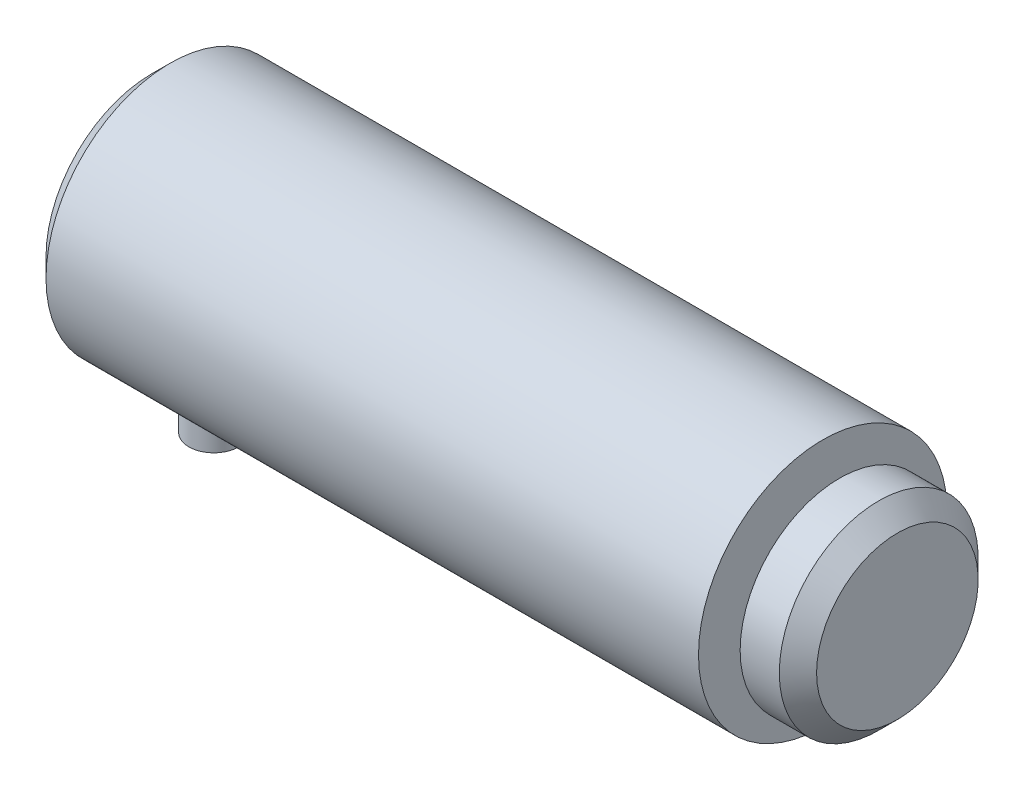
ISO-10303-21;
HEADER;
FILE_DESCRIPTION(('STEP AP214'),'2;1');
FILE_NAME('part.step','',(''),(''),'','','');
FILE_SCHEMA(('AUTOMOTIVE_DESIGN { 1 0 10303 214 1 1 1 1 }'));
ENDSEC;
DATA;
#1=APPLICATION_CONTEXT('core data for automotive mechanical design processes');
#2=APPLICATION_PROTOCOL_DEFINITION('international standard','automotive_design',2000,#1);
#3=PRODUCT_CONTEXT('',#1,'mechanical');
#4=PRODUCT('Part','Part','',(#3));
#5=PRODUCT_RELATED_PRODUCT_CATEGORY('part','',(#4));
#6=PRODUCT_DEFINITION_FORMATION('','',#4);
#7=PRODUCT_DEFINITION_CONTEXT('part definition',#1,'design');
#8=PRODUCT_DEFINITION('design','',#6,#7);
#9=PRODUCT_DEFINITION_SHAPE('','',#8);
#10=(LENGTH_UNIT() NAMED_UNIT(*) SI_UNIT(.MILLI.,.METRE.));
#11=(NAMED_UNIT(*) PLANE_ANGLE_UNIT() SI_UNIT($,.RADIAN.));
#12=(NAMED_UNIT(*) SI_UNIT($,.STERADIAN.) SOLID_ANGLE_UNIT());
#13=UNCERTAINTY_MEASURE_WITH_UNIT(LENGTH_MEASURE(1.E-05),#10,'distance_accuracy_value','');
#14=(GEOMETRIC_REPRESENTATION_CONTEXT(3) GLOBAL_UNCERTAINTY_ASSIGNED_CONTEXT((#13)) GLOBAL_UNIT_ASSIGNED_CONTEXT((#10,
#11,#12)) REPRESENTATION_CONTEXT('',''));
#15=CARTESIAN_POINT('',(0.,0.,0.));
#16=DIRECTION('',(0.,0.,1.));
#17=DIRECTION('',(1.,0.,0.));
#18=AXIS2_PLACEMENT_3D('',#15,#16,#17);
#19=CARTESIAN_POINT('',(30.,0.,0.));
#20=DIRECTION('',(-1.,0.,0.));
#21=DIRECTION('',(0.,0.,1.));
#22=AXIS2_PLACEMENT_3D('',#19,#20,#21);
#23=CYLINDRICAL_SURFACE('',#22,8.);
#24=CARTESIAN_POINT('',(25.35,0.,0.));
#25=DIRECTION('',(-1.,0.,0.));
#26=DIRECTION('',(0.,0.,1.));
#27=AXIS2_PLACEMENT_3D('',#24,#25,#26);
#28=CIRCLE('',#27,8.);
#29=CARTESIAN_POINT('',(25.35,0.,8.));
#30=VERTEX_POINT('',#29);
#31=EDGE_CURVE('E61',#30,#30,#28,.T.);
#32=ORIENTED_EDGE('',*,*,#31,.F.);
#33=EDGE_LOOP('',(#32));
#34=FACE_BOUND('',#33,.T.);
#35=CARTESIAN_POINT('',(28.5,0.,0.));
#36=DIRECTION('',(-1.,0.,0.));
#37=DIRECTION('',(0.,0.,1.));
#38=AXIS2_PLACEMENT_3D('',#35,#36,#37);
#39=CIRCLE('',#38,8.);
#40=CARTESIAN_POINT('',(28.5,0.,8.));
#41=VERTEX_POINT('',#40);
#42=EDGE_CURVE('E67',#41,#41,#39,.T.);
#43=ORIENTED_EDGE('',*,*,#42,.T.);
#44=EDGE_LOOP('',(#43));
#45=FACE_BOUND('',#44,.T.);
#46=ADVANCED_FACE('F31',(#34,#45),#23,.T.);
#47=CARTESIAN_POINT('',(24.,0.,0.));
#48=DIRECTION('',(-1.,0.,0.));
#49=DIRECTION('',(0.,0.,1.));
#50=AXIS2_PLACEMENT_3D('',#47,#48,#49);
#51=CYLINDRICAL_SURFACE('',#50,10.);
#52=CARTESIAN_POINT('',(-25.,-9.79795897113271,2.));
#53=CARTESIAN_POINT('',(-24.8888712490177,-9.79796118053292,1.99999589175054));
#54=CARTESIAN_POINT('',(-24.7776907533333,-9.79987016537404,1.99070634343629));
#55=CARTESIAN_POINT('',(-24.5584749897137,-9.80728862609749,1.95382456716568));
#56=CARTESIAN_POINT('',(-24.450442310728,-9.81280098289574,1.92621769414099));
#57=CARTESIAN_POINT('',(-24.2407253932916,-9.82677747443709,1.85359156523949));
#58=CARTESIAN_POINT('',(-24.1390349569348,-9.83523867242151,1.80858962830524));
#59=CARTESIAN_POINT('',(-23.9446503106061,-9.85415598961317,1.70249821534101));
#60=CARTESIAN_POINT('',(-23.8519555989242,-9.86461199746922,1.6414096372023));
#61=CARTESIAN_POINT('',(-23.6768779922923,-9.88650599388505,1.50395815130688));
#62=CARTESIAN_POINT('',(-23.5946408242321,-9.89795475674493,1.42741131182664));
#63=CARTESIAN_POINT('',(-23.444084932842,-9.92044944605197,1.26161357804262));
#64=CARTESIAN_POINT('',(-23.3757671851656,-9.93149534421663,1.17236179395597));
#65=CARTESIAN_POINT('',(-23.2544239647431,-9.95205592835124,0.982722711848512));
#66=CARTESIAN_POINT('',(-23.2015369723667,-9.96155642883101,0.882245135344422));
#67=CARTESIAN_POINT('',(-23.1134501259037,-9.97783473767263,0.673608300774544));
#68=CARTESIAN_POINT('',(-23.078248616198,-9.98461280088238,0.565449762841106));
#69=CARTESIAN_POINT('',(-23.0269856127607,-9.99460641376837,0.346033546556989));
#70=CARTESIAN_POINT('',(-23.010678044858,-9.99786772576254,0.234835478429628));
#71=CARTESIAN_POINT('',(-22.9968980963234,-10.0006184236721,0.0112371368750725));
#72=CARTESIAN_POINT('',(-22.9994239007084,-10.0001081730552,-0.101163019663686));
#73=CARTESIAN_POINT('',(-23.0230523604311,-9.99540869737031,-0.322284001487177));
#74=CARTESIAN_POINT('',(-23.0438899543357,-9.99127196731677,-0.43103442859694));
#75=CARTESIAN_POINT('',(-23.1031300649178,-9.97984354318817,-0.643463253160603));
#76=CARTESIAN_POINT('',(-23.1415332843837,-9.97255172288078,-0.747141447494258));
#77=CARTESIAN_POINT('',(-23.2350600802945,-9.95554592039917,-0.947238926401775));
#78=CARTESIAN_POINT('',(-23.2902875022098,-9.94581696350447,-1.0436083482678));
#79=CARTESIAN_POINT('',(-23.4158181544732,-9.92500938947571,-1.22581009171951));
#80=CARTESIAN_POINT('',(-23.486123119541,-9.91393061710444,-1.31164119905));
#81=CARTESIAN_POINT('',(-23.6412672442169,-9.89141928728919,-1.47190286210691));
#82=CARTESIAN_POINT('',(-23.7263383734592,-9.87998392915032,-1.54610863314726));
#83=CARTESIAN_POINT('',(-23.9078328849015,-9.85823143197521,-1.67923698635361));
#84=CARTESIAN_POINT('',(-24.0042564817664,-9.84791431409096,-1.7381592794555));
#85=CARTESIAN_POINT('',(-24.2060416636436,-9.82956094945847,-1.83912562960376));
#86=CARTESIAN_POINT('',(-24.3114219352793,-9.82152963127098,-1.88113329555542));
#87=CARTESIAN_POINT('',(-24.527942647448,-9.80872952642545,-1.94678068325517));
#88=CARTESIAN_POINT('',(-24.6390823352382,-9.80396031456855,-1.97042279891329));
#89=CARTESIAN_POINT('',(-24.8619297159981,-9.79830958535655,-1.9983320120721));
#90=CARTESIAN_POINT('',(-24.9735951486207,-9.79736294114308,-2.00292371779582));
#91=CARTESIAN_POINT('',(-25.1960964463994,-9.79928971377708,-1.99347525662148));
#92=CARTESIAN_POINT('',(-25.3069323582377,-9.80216291400776,-1.97943614624489));
#93=CARTESIAN_POINT('',(-25.5235372805845,-9.81134464989829,-1.93340441614832));
#94=CARTESIAN_POINT('',(-25.6293446860715,-9.81761998028993,-1.9015852416786));
#95=CARTESIAN_POINT('',(-25.8341265580575,-9.83286978703329,-1.82108207061704));
#96=CARTESIAN_POINT('',(-25.9331004608714,-9.84184448572539,-1.77239668474636));
#97=CARTESIAN_POINT('',(-26.1228262199003,-9.86162811924079,-1.6588082844312));
#98=CARTESIAN_POINT('',(-26.2134540926017,-9.87245943729806,-1.59370215596551));
#99=CARTESIAN_POINT('',(-26.3826166240018,-9.89467447653273,-1.44939114442542));
#100=CARTESIAN_POINT('',(-26.4611500364985,-9.90605825447636,-1.37018481028907));
#101=CARTESIAN_POINT('',(-26.6051251183712,-9.92830691738431,-1.19846454699578));
#102=CARTESIAN_POINT('',(-26.6703473093,-9.93916115417367,-1.10576499785926));
#103=CARTESIAN_POINT('',(-26.7842917629992,-9.9589425525724,-0.91053579326951));
#104=CARTESIAN_POINT('',(-26.8330147186896,-9.96786979510422,-0.808006550867012));
#105=CARTESIAN_POINT('',(-26.9122577434933,-9.98274588122133,-0.596605361648024));
#106=CARTESIAN_POINT('',(-26.9428810364525,-9.98871158285205,-0.487773346956156));
#107=CARTESIAN_POINT('',(-26.9853824953277,-9.99706471875323,-0.266378909359823));
#108=CARTESIAN_POINT('',(-26.9972629189514,-9.99945258399698,-0.153816937422423));
#109=CARTESIAN_POINT('',(-27.0018539619258,-10.0003708090823,0.0697457878072428));
#110=CARTESIAN_POINT('',(-26.9948945609125,-9.99896757098659,0.180739624282989));
#111=CARTESIAN_POINT('',(-26.9627320989044,-9.99260087120678,0.399942062631301));
#112=CARTESIAN_POINT('',(-26.9375292673037,-9.98763745428862,0.508150699507446));
#113=CARTESIAN_POINT('',(-26.8697420158168,-9.97470996729841,0.71850549949013));
#114=CARTESIAN_POINT('',(-26.8271972437381,-9.9667527449523,0.820664886480329));
#115=CARTESIAN_POINT('',(-26.7259755173378,-9.9486944424736,1.01644244037214));
#116=CARTESIAN_POINT('',(-26.667297288191,-9.93859319293976,1.11005993153569));
#117=CARTESIAN_POINT('',(-26.5343612258774,-9.91715198313481,1.28772778021183));
#118=CARTESIAN_POINT('',(-26.4598673272325,-9.90579466835802,1.37159943222969));
#119=CARTESIAN_POINT('',(-26.2978995198025,-9.8832244581573,1.52576523551702));
#120=CARTESIAN_POINT('',(-26.2104225410401,-9.87201159757438,1.59605616641783));
#121=CARTESIAN_POINT('',(-26.0238413666191,-9.85086685467863,1.72178443889997));
#122=CARTESIAN_POINT('',(-25.9246220777575,-9.84095007142452,1.77705362923618));
#123=CARTESIAN_POINT('',(-25.7181344534798,-9.82370474252826,1.87004809853245));
#124=CARTESIAN_POINT('',(-25.6108735226256,-9.81637385049968,1.90778929194833));
#125=CARTESIAN_POINT('',(-25.4194750891143,-9.8065936227569,1.95733827971531));
#126=CARTESIAN_POINT('',(-25.3364291609721,-9.80337569829212,1.97330779704737));
#127=CARTESIAN_POINT('',(-25.1689320908977,-9.79905756918169,1.99464003591942));
#128=CARTESIAN_POINT('',(-25.0844809975111,-9.79795729152836,2.00000312312529));
#129=CARTESIAN_POINT('',(-25.,-9.79795897113271,2.));
#130=B_SPLINE_CURVE_WITH_KNOTS('',3,(#52,#53,#54,#55,#56,#57,#58,#59,#60,#61,#62,#63,#64,#65,
#66,#67,#68,#69,#70,#71,#72,#73,#74,#75,#76,#77,#78,#79,#80,#81,#82,#83,#84,#85,#86,#87,#88,#89,
#90,#91,#92,#93,#94,#95,#96,#97,#98,#99,#100,#101,#102,#103,#104,#105,#106,#107,#108,#109,#110,
#111,#112,#113,#114,#115,#116,#117,#118,#119,#120,#121,#122,#123,#124,#125,#126,#127,#128,#129),
.UNSPECIFIED.,.T.,.F.,(4,2,2,2,2,2,2,2,2,2,2,2,2,2,2,2,2,2,2,2,2,2,2,2,2,2,2,2,2,2,2,2,2,2,2,2,
2,2,4),(0.,0.333076927738854,0.666420478568594,0.999432995881173,1.33242692971973,
1.66964505096873,2.00688680070844,2.347068008749,2.6872173649312,3.02288497766161,
3.35852024232497,3.68937579267075,4.02024458147501,4.35319848444607,4.68619071540132,
5.02498693524967,5.36378956245441,5.70331726345553,6.0428007003205,6.37647515609187,
6.71013069056843,7.04058683566638,7.37107020708797,7.70586119549043,8.04068665740419,
8.38065203466902,8.7206031326021,9.05859627157301,9.39654869383257,9.72862034829373,
10.0606878273351,10.392000341509,10.7233390426937,11.0600230405119,11.3967867777956,
11.7371779715922,12.077259501804,12.3304760727632,12.5836839137096),.UNSPECIFIED.);
#131=CARTESIAN_POINT('',(-25.,-9.79795897113271,2.));
#132=VERTEX_POINT('',#131);
#133=EDGE_CURVE('E35',#132,#132,#130,.T.);
#134=ORIENTED_EDGE('',*,*,#133,.T.);
#135=EDGE_LOOP('',(#134));
#136=FACE_BOUND('',#135,.T.);
#137=CARTESIAN_POINT('',(24.,0.,0.));
#138=DIRECTION('',(-1.,0.,0.));
#139=DIRECTION('',(0.,0.,1.));
#140=AXIS2_PLACEMENT_3D('',#137,#138,#139);
#141=CIRCLE('',#140,10.);
#142=CARTESIAN_POINT('',(24.,0.,10.));
#143=VERTEX_POINT('',#142);
#144=EDGE_CURVE('E10',#143,#143,#141,.T.);
#145=ORIENTED_EDGE('',*,*,#144,.T.);
#146=EDGE_LOOP('',(#145));
#147=FACE_BOUND('',#146,.T.);
#148=CARTESIAN_POINT('',(-28.5,0.,0.));
#149=DIRECTION('',(-1.,0.,0.));
#150=DIRECTION('',(0.,0.,1.));
#151=AXIS2_PLACEMENT_3D('',#148,#149,#150);
#152=CIRCLE('',#151,10.);
#153=CARTESIAN_POINT('',(-28.5,0.,10.));
#154=VERTEX_POINT('',#153);
#155=EDGE_CURVE('E43',#154,#154,#152,.T.);
#156=ORIENTED_EDGE('',*,*,#155,.F.);
#157=EDGE_LOOP('',(#156));
#158=FACE_BOUND('',#157,.T.);
#159=ADVANCED_FACE('F88',(#136,#147,#158),#51,.T.);
#160=CARTESIAN_POINT('',(24.,10.,0.));
#161=DIRECTION('',(-1.,0.,0.));
#162=DIRECTION('',(0.,0.,1.));
#163=AXIS2_PLACEMENT_3D('',#160,#161,#162);
#164=PLANE('',#163);
#165=ORIENTED_EDGE('',*,*,#144,.F.);
#166=EDGE_LOOP('',(#165));
#167=FACE_BOUND('',#166,.T.);
#168=CARTESIAN_POINT('',(24.,0.,0.));
#169=DIRECTION('',(-1.,0.,0.));
#170=DIRECTION('',(0.,0.,1.));
#171=AXIS2_PLACEMENT_3D('',#168,#169,#170);
#172=CIRCLE('',#171,6.);
#173=CARTESIAN_POINT('',(24.,0.,6.));
#174=VERTEX_POINT('',#173);
#175=EDGE_CURVE('E55',#174,#174,#172,.T.);
#176=ORIENTED_EDGE('',*,*,#175,.T.);
#177=EDGE_LOOP('',(#176));
#178=FACE_BOUND('',#177,.T.);
#179=ADVANCED_FACE('F94',(#167,#178),#164,.F.);
#180=CARTESIAN_POINT('',(-30.,0.,0.));
#181=DIRECTION('',(1.,0.,0.));
#182=DIRECTION('',(0.,0.,-1.));
#183=AXIS2_PLACEMENT_3D('',#180,#181,#182);
#184=CONICAL_SURFACE('',#183,8.5,0.785398163397448);
#185=ORIENTED_EDGE('',*,*,#155,.T.);
#186=EDGE_LOOP('',(#185));
#187=FACE_BOUND('',#186,.T.);
#188=CARTESIAN_POINT('',(-30.,0.,0.));
#189=DIRECTION('',(-1.,0.,0.));
#190=DIRECTION('',(0.,0.,1.));
#191=AXIS2_PLACEMENT_3D('',#188,#189,#190);
#192=CIRCLE('',#191,8.5);
#193=CARTESIAN_POINT('',(-30.,0.,8.5));
#194=VERTEX_POINT('',#193);
#195=EDGE_CURVE('E47',#194,#194,#192,.T.);
#196=ORIENTED_EDGE('',*,*,#195,.F.);
#197=EDGE_LOOP('',(#196));
#198=FACE_BOUND('',#197,.T.);
#199=ADVANCED_FACE('F107',(#187,#198),#184,.T.);
#200=CARTESIAN_POINT('',(-30.,0.,0.));
#201=DIRECTION('',(1.,0.,0.));
#202=DIRECTION('',(0.,0.,-1.));
#203=AXIS2_PLACEMENT_3D('',#200,#201,#202);
#204=PLANE('',#203);
#205=ORIENTED_EDGE('',*,*,#195,.T.);
#206=EDGE_LOOP('',(#205));
#207=FACE_BOUND('',#206,.T.);
#208=ADVANCED_FACE('F33',(#207),#204,.F.);
#209=CARTESIAN_POINT('',(-25.,-14.,0.));
#210=DIRECTION('',(0.,1.,0.));
#211=DIRECTION('',(0.,0.,1.));
#212=AXIS2_PLACEMENT_3D('',#209,#210,#211);
#213=CYLINDRICAL_SURFACE('',#212,2.);
#214=CARTESIAN_POINT('',(-25.,-14.,0.));
#215=DIRECTION('',(0.,1.,0.));
#216=DIRECTION('',(0.,0.,1.));
#217=AXIS2_PLACEMENT_3D('',#214,#215,#216);
#218=CIRCLE('',#217,2.);
#219=CARTESIAN_POINT('',(-25.,-14.,2.));
#220=VERTEX_POINT('',#219);
#221=EDGE_CURVE('E52',#220,#220,#218,.T.);
#222=ORIENTED_EDGE('',*,*,#221,.T.);
#223=EDGE_LOOP('',(#222));
#224=FACE_BOUND('',#223,.T.);
#225=ORIENTED_EDGE('',*,*,#133,.F.);
#226=EDGE_LOOP('',(#225));
#227=FACE_BOUND('',#226,.T.);
#228=ADVANCED_FACE('F101',(#224,#227),#213,.T.);
#229=CARTESIAN_POINT('',(-25.,-14.,0.));
#230=DIRECTION('',(0.,1.,0.));
#231=DIRECTION('',(0.,0.,1.));
#232=AXIS2_PLACEMENT_3D('',#229,#230,#231);
#233=PLANE('',#232);
#234=ORIENTED_EDGE('',*,*,#221,.F.);
#235=EDGE_LOOP('',(#234));
#236=FACE_BOUND('',#235,.T.);
#237=ADVANCED_FACE('F99',(#236),#233,.F.);
#238=CARTESIAN_POINT('',(49.,0.,0.));
#239=DIRECTION('',(-1.,0.,0.));
#240=DIRECTION('',(0.,0.,1.));
#241=AXIS2_PLACEMENT_3D('',#238,#239,#240);
#242=CYLINDRICAL_SURFACE('',#241,6.);
#243=CARTESIAN_POINT('',(25.35,0.,0.));
#244=DIRECTION('',(-1.,0.,0.));
#245=DIRECTION('',(0.,0.,1.));
#246=AXIS2_PLACEMENT_3D('',#243,#244,#245);
#247=CIRCLE('',#246,6.);
#248=CARTESIAN_POINT('',(25.35,0.,6.));
#249=VERTEX_POINT('',#248);
#250=EDGE_CURVE('E58',#249,#249,#247,.T.);
#251=ORIENTED_EDGE('',*,*,#250,.T.);
#252=EDGE_LOOP('',(#251));
#253=FACE_BOUND('',#252,.T.);
#254=ORIENTED_EDGE('',*,*,#175,.F.);
#255=EDGE_LOOP('',(#254));
#256=FACE_BOUND('',#255,.T.);
#257=ADVANCED_FACE('F84',(#253,#256),#242,.T.);
#258=CARTESIAN_POINT('',(25.35,6.,0.));
#259=DIRECTION('',(-1.,0.,0.));
#260=DIRECTION('',(0.,0.,1.));
#261=AXIS2_PLACEMENT_3D('',#258,#259,#260);
#262=PLANE('',#261);
#263=ORIENTED_EDGE('',*,*,#31,.T.);
#264=EDGE_LOOP('',(#263));
#265=FACE_BOUND('',#264,.T.);
#266=ORIENTED_EDGE('',*,*,#250,.F.);
#267=EDGE_LOOP('',(#266));
#268=FACE_BOUND('',#267,.T.);
#269=ADVANCED_FACE('F75',(#265,#268),#262,.T.);
#270=CARTESIAN_POINT('',(28.5,0.,0.));
#271=DIRECTION('',(-1.,0.,0.));
#272=DIRECTION('',(0.,0.,1.));
#273=AXIS2_PLACEMENT_3D('',#270,#271,#272);
#274=CONICAL_SURFACE('',#273,8.,0.785398163397449);
#275=CARTESIAN_POINT('',(30.,0.,0.));
#276=DIRECTION('',(-1.,0.,0.));
#277=DIRECTION('',(0.,0.,1.));
#278=AXIS2_PLACEMENT_3D('',#275,#276,#277);
#279=CIRCLE('',#278,6.5);
#280=CARTESIAN_POINT('',(30.,0.,6.5));
#281=VERTEX_POINT('',#280);
#282=EDGE_CURVE('E64',#281,#281,#279,.T.);
#283=ORIENTED_EDGE('',*,*,#282,.T.);
#284=EDGE_LOOP('',(#283));
#285=FACE_BOUND('',#284,.T.);
#286=ORIENTED_EDGE('',*,*,#42,.F.);
#287=EDGE_LOOP('',(#286));
#288=FACE_BOUND('',#287,.T.);
#289=ADVANCED_FACE('F72',(#285,#288),#274,.T.);
#290=CARTESIAN_POINT('',(30.,8.,0.));
#291=DIRECTION('',(-1.,0.,0.));
#292=DIRECTION('',(0.,0.,1.));
#293=AXIS2_PLACEMENT_3D('',#290,#291,#292);
#294=PLANE('',#293);
#295=ORIENTED_EDGE('',*,*,#282,.F.);
#296=EDGE_LOOP('',(#295));
#297=FACE_BOUND('',#296,.T.);
#298=ADVANCED_FACE('F74',(#297),#294,.F.);
#299=CLOSED_SHELL('',(#46,#159,#179,#199,#208,#228,#237,#257,#269,#289,#298));
#300=MANIFOLD_SOLID_BREP('B2',#299);
#301=ADVANCED_BREP_SHAPE_REPRESENTATION('',(#18,#300),#14);
#302=SHAPE_DEFINITION_REPRESENTATION(#9,#301);
ENDSEC;
END-ISO-10303-21;
